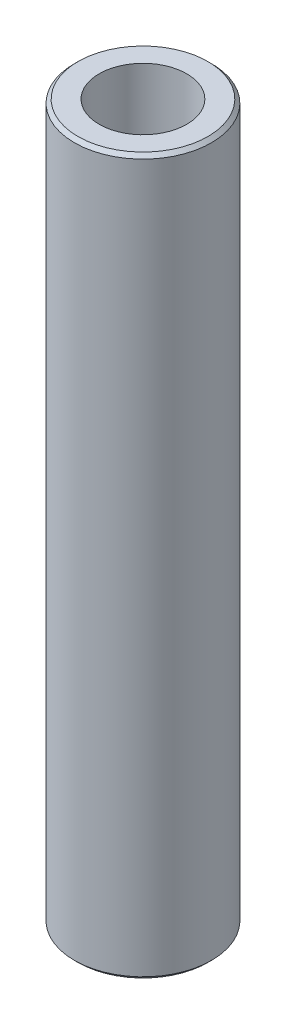
ISO-10303-21;
HEADER;
FILE_DESCRIPTION(('STEP AP214'),'2;1');
FILE_NAME('part.step','',(''),(''),'','','');
FILE_SCHEMA(('AUTOMOTIVE_DESIGN { 1 0 10303 214 1 1 1 1 }'));
ENDSEC;
DATA;
#1=APPLICATION_CONTEXT('core data for automotive mechanical design processes');
#2=APPLICATION_PROTOCOL_DEFINITION('international standard','automotive_design',2000,#1);
#3=PRODUCT_CONTEXT('',#1,'mechanical');
#4=PRODUCT('Part','Part','',(#3));
#5=PRODUCT_RELATED_PRODUCT_CATEGORY('part','',(#4));
#6=PRODUCT_DEFINITION_FORMATION('','',#4);
#7=PRODUCT_DEFINITION_CONTEXT('part definition',#1,'design');
#8=PRODUCT_DEFINITION('design','',#6,#7);
#9=PRODUCT_DEFINITION_SHAPE('','',#8);
#10=(LENGTH_UNIT() NAMED_UNIT(*) SI_UNIT(.MILLI.,.METRE.));
#11=(NAMED_UNIT(*) PLANE_ANGLE_UNIT() SI_UNIT($,.RADIAN.));
#12=(NAMED_UNIT(*) SI_UNIT($,.STERADIAN.) SOLID_ANGLE_UNIT());
#13=UNCERTAINTY_MEASURE_WITH_UNIT(LENGTH_MEASURE(1.E-05),#10,'distance_accuracy_value','');
#14=(GEOMETRIC_REPRESENTATION_CONTEXT(3) GLOBAL_UNCERTAINTY_ASSIGNED_CONTEXT((#13)) GLOBAL_UNIT_ASSIGNED_CONTEXT((#10,
#11,#12)) REPRESENTATION_CONTEXT('',''));
#15=CARTESIAN_POINT('',(0.,0.,0.));
#16=DIRECTION('',(0.,0.,1.));
#17=DIRECTION('',(1.,0.,0.));
#18=AXIS2_PLACEMENT_3D('',#15,#16,#17);
#19=CARTESIAN_POINT('',(0.,600.,0.));
#20=DIRECTION('',(0.,-1.,0.));
#21=DIRECTION('',(0.,0.,-1.));
#22=AXIS2_PLACEMENT_3D('',#19,#20,#21);
#23=CYLINDRICAL_SURFACE('',#22,57.5);
#24=CARTESIAN_POINT('',(0.,596.989709416284,0.));
#25=DIRECTION('',(0.,1.,0.));
#26=DIRECTION('',(0.,0.,1.));
#27=AXIS2_PLACEMENT_3D('',#24,#25,#26);
#28=CIRCLE('',#27,57.5);
#29=CARTESIAN_POINT('',(0.,596.989709416284,57.5));
#30=VERTEX_POINT('',#29);
#31=EDGE_CURVE('E50',#30,#30,#28,.F.);
#32=ORIENTED_EDGE('',*,*,#31,.T.);
#33=EDGE_LOOP('',(#32));
#34=FACE_BOUND('',#33,.T.);
#35=CARTESIAN_POINT('',(0.,3.01029058371627,0.));
#36=DIRECTION('',(0.,1.,0.));
#37=DIRECTION('',(0.,0.,1.));
#38=AXIS2_PLACEMENT_3D('',#35,#36,#37);
#39=CIRCLE('',#38,57.5);
#40=CARTESIAN_POINT('',(0.,3.01029058371627,57.5));
#41=VERTEX_POINT('',#40);
#42=EDGE_CURVE('E51',#41,#41,#39,.T.);
#43=ORIENTED_EDGE('',*,*,#42,.T.);
#44=EDGE_LOOP('',(#43));
#45=FACE_BOUND('',#44,.T.);
#46=ADVANCED_FACE('F39',(#34,#45),#23,.T.);
#47=CARTESIAN_POINT('',(0.,600.,0.));
#48=DIRECTION('',(0.,1.,0.));
#49=DIRECTION('',(0.,0.,1.));
#50=AXIS2_PLACEMENT_3D('',#47,#48,#49);
#51=PLANE('',#50);
#52=CARTESIAN_POINT('',(0.,600.,0.));
#53=DIRECTION('',(0.,1.,0.));
#54=DIRECTION('',(0.,0.,1.));
#55=AXIS2_PLACEMENT_3D('',#52,#53,#54);
#56=CIRCLE('',#55,54.4897094162837);
#57=CARTESIAN_POINT('',(0.,600.,54.4897094162837));
#58=VERTEX_POINT('',#57);
#59=EDGE_CURVE('E54',#58,#58,#56,.T.);
#60=ORIENTED_EDGE('',*,*,#59,.T.);
#61=EDGE_LOOP('',(#60));
#62=FACE_BOUND('',#61,.T.);
#63=CARTESIAN_POINT('',(0.,600.,0.));
#64=DIRECTION('',(0.,1.,0.));
#65=DIRECTION('',(0.,0.,1.));
#66=AXIS2_PLACEMENT_3D('',#63,#64,#65);
#67=CIRCLE('',#66,36.7354089002283);
#68=CARTESIAN_POINT('',(0.,600.,36.7354089002283));
#69=VERTEX_POINT('',#68);
#70=EDGE_CURVE('E58',#69,#69,#67,.T.);
#71=ORIENTED_EDGE('',*,*,#70,.F.);
#72=EDGE_LOOP('',(#71));
#73=FACE_BOUND('',#72,.T.);
#74=ADVANCED_FACE('F69',(#62,#73),#51,.T.);
#75=CARTESIAN_POINT('',(0.,0.,0.));
#76=DIRECTION('',(0.,1.,0.));
#77=DIRECTION('',(0.,0.,1.));
#78=AXIS2_PLACEMENT_3D('',#75,#76,#77);
#79=PLANE('',#78);
#80=CARTESIAN_POINT('',(0.,0.,0.));
#81=DIRECTION('',(0.,1.,0.));
#82=DIRECTION('',(0.,0.,1.));
#83=AXIS2_PLACEMENT_3D('',#80,#81,#82);
#84=CIRCLE('',#83,54.4897094162837);
#85=CARTESIAN_POINT('',(0.,0.,54.4897094162837));
#86=VERTEX_POINT('',#85);
#87=EDGE_CURVE('E10',#86,#86,#84,.F.);
#88=ORIENTED_EDGE('',*,*,#87,.T.);
#89=EDGE_LOOP('',(#88));
#90=FACE_BOUND('',#89,.T.);
#91=CARTESIAN_POINT('',(0.,0.,0.));
#92=DIRECTION('',(0.,1.,0.));
#93=DIRECTION('',(0.,0.,1.));
#94=AXIS2_PLACEMENT_3D('',#91,#92,#93);
#95=CIRCLE('',#94,36.7354089002283);
#96=CARTESIAN_POINT('',(0.,0.,36.7354089002283));
#97=VERTEX_POINT('',#96);
#98=EDGE_CURVE('E63',#97,#97,#95,.T.);
#99=ORIENTED_EDGE('',*,*,#98,.T.);
#100=EDGE_LOOP('',(#99));
#101=FACE_BOUND('',#100,.T.);
#102=ADVANCED_FACE('F75',(#90,#101),#79,.F.);
#103=CARTESIAN_POINT('',(0.,600.,0.));
#104=DIRECTION('',(0.,-1.,0.));
#105=DIRECTION('',(0.,0.,-1.));
#106=AXIS2_PLACEMENT_3D('',#103,#104,#105);
#107=CYLINDRICAL_SURFACE('',#106,36.7354089002283);
#108=ORIENTED_EDGE('',*,*,#70,.T.);
#109=EDGE_LOOP('',(#108));
#110=FACE_BOUND('',#109,.T.);
#111=ORIENTED_EDGE('',*,*,#98,.F.);
#112=EDGE_LOOP('',(#111));
#113=FACE_BOUND('',#112,.T.);
#114=ADVANCED_FACE('F70',(#110,#113),#107,.F.);
#115=CARTESIAN_POINT('',(0.,600.,0.));
#116=DIRECTION('',(0.,-1.,0.));
#117=DIRECTION('',(0.,0.,-1.));
#118=AXIS2_PLACEMENT_3D('',#115,#116,#117);
#119=CONICAL_SURFACE('',#118,54.4897094162837,0.78539816339744);
#120=ORIENTED_EDGE('',*,*,#31,.F.);
#121=EDGE_LOOP('',(#120));
#122=FACE_BOUND('',#121,.T.);
#123=ORIENTED_EDGE('',*,*,#59,.F.);
#124=EDGE_LOOP('',(#123));
#125=FACE_BOUND('',#124,.T.);
#126=ADVANCED_FACE('F81',(#122,#125),#119,.T.);
#127=CARTESIAN_POINT('',(0.,3.01029058371627,0.));
#128=DIRECTION('',(0.,1.,0.));
#129=DIRECTION('',(0.,0.,1.));
#130=AXIS2_PLACEMENT_3D('',#127,#128,#129);
#131=CONICAL_SURFACE('',#130,57.5,0.785398163397448);
#132=CARTESIAN_POINT('',(0.,0.,54.4897094162837));
#133=CARTESIAN_POINT('',(0.,0.0313571935803793,54.5210666098641));
#134=CARTESIAN_POINT('',(0.,0.0627143871607564,54.5524238034445));
#135=CARTESIAN_POINT('',(0.,0.125428774321511,54.6151381906052));
#136=CARTESIAN_POINT('',(0.,0.156785967901888,54.6464953841856));
#137=CARTESIAN_POINT('',(0.,0.219500355062644,54.7092097713464));
#138=CARTESIAN_POINT('',(0.,0.250857548643023,54.7405669649268));
#139=CARTESIAN_POINT('',(0.,0.313571935803778,54.8032813520875));
#140=CARTESIAN_POINT('',(0.,0.344929129384155,54.8346385456679));
#141=CARTESIAN_POINT('',(0.,0.40764351654491,54.8973529328286));
#142=CARTESIAN_POINT('',(0.,0.439000710125289,54.928710126409));
#143=CARTESIAN_POINT('',(0.,0.501715097286045,54.9914245135698));
#144=CARTESIAN_POINT('',(0.,0.533072290866421,55.0227817071502));
#145=CARTESIAN_POINT('',(0.,0.595786678027177,55.0854960943109));
#146=CARTESIAN_POINT('',(0.,0.627143871607556,55.1168532878913));
#147=CARTESIAN_POINT('',(0.,0.689858258768312,55.179567675052));
#148=CARTESIAN_POINT('',(0.,0.721215452348688,55.2109248686324));
#149=CARTESIAN_POINT('',(0.,0.783929839509444,55.2736392557932));
#150=CARTESIAN_POINT('',(0.,0.815287033089823,55.3049964493736));
#151=CARTESIAN_POINT('',(0.,0.878001420250578,55.3677108365343));
#152=CARTESIAN_POINT('',(0.,0.909358613830955,55.3990680301147));
#153=CARTESIAN_POINT('',(0.,0.972073000991711,55.4617824172754));
#154=CARTESIAN_POINT('',(0.,1.00343019457209,55.4931396108558));
#155=CARTESIAN_POINT('',(0.,1.06614458173285,55.5558539980166));
#156=CARTESIAN_POINT('',(0.,1.09750177531322,55.587211191597));
#157=CARTESIAN_POINT('',(0.,1.16021616247398,55.6499255787577));
#158=CARTESIAN_POINT('',(0.,1.19157335605436,55.6812827723381));
#159=CARTESIAN_POINT('',(0.,1.25428774321511,55.7439971594988));
#160=CARTESIAN_POINT('',(0.,1.28564493679549,55.7753543530792));
#161=CARTESIAN_POINT('',(0.,1.34835932395624,55.83806874024));
#162=CARTESIAN_POINT('',(0.,1.37971651753662,55.8694259338204));
#163=CARTESIAN_POINT('',(0.,1.44243090469738,55.9321403209811));
#164=CARTESIAN_POINT('',(0.,1.47378809827776,55.9634975145615));
#165=CARTESIAN_POINT('',(0.,1.53650248543851,56.0262119017222));
#166=CARTESIAN_POINT('',(0.,1.56785967901889,56.0575690953026));
#167=CARTESIAN_POINT('',(0.,1.63057406617965,56.1202834824634));
#168=CARTESIAN_POINT('',(0.,1.66193125976002,56.1516406760438));
#169=CARTESIAN_POINT('',(0.,1.72464564692078,56.2143550632045));
#170=CARTESIAN_POINT('',(0.,1.75600284050116,56.2457122567849));
#171=CARTESIAN_POINT('',(0.,1.81871722766191,56.3084266439456));
#172=CARTESIAN_POINT('',(0.,1.85007442124229,56.339783837526));
#173=CARTESIAN_POINT('',(0.,1.91278880840304,56.4024982246868));
#174=CARTESIAN_POINT('',(0.,1.94414600198342,56.4338554182672));
#175=CARTESIAN_POINT('',(0.,2.00686038914418,56.4965698054279));
#176=CARTESIAN_POINT('',(0.,2.03821758272456,56.5279269990083));
#177=CARTESIAN_POINT('',(0.,2.10093196988531,56.590641386169));
#178=CARTESIAN_POINT('',(0.,2.13228916346569,56.6219985797494));
#179=CARTESIAN_POINT('',(0.,2.19500355062645,56.6847129669102));
#180=CARTESIAN_POINT('',(0.,2.22636074420682,56.7160701604906));
#181=CARTESIAN_POINT('',(0.,2.28907513136758,56.7787845476513));
#182=CARTESIAN_POINT('',(0.,2.32043232494796,56.8101417412317));
#183=CARTESIAN_POINT('',(0.,2.38314671210871,56.8728561283924));
#184=CARTESIAN_POINT('',(0.,2.41450390568909,56.9042133219728));
#185=CARTESIAN_POINT('',(0.,2.47721829284984,56.9669277091336));
#186=CARTESIAN_POINT('',(0.,2.50857548643022,56.998284902714));
#187=CARTESIAN_POINT('',(0.,2.57128987359098,57.0609992898747));
#188=CARTESIAN_POINT('',(0.,2.60264706717136,57.0923564834551));
#189=CARTESIAN_POINT('',(0.,2.66536145433211,57.1550708706158));
#190=CARTESIAN_POINT('',(0.,2.69671864791249,57.1864280641962));
#191=CARTESIAN_POINT('',(0.,2.75943303507325,57.249142451357));
#192=CARTESIAN_POINT('',(0.,2.79079022865362,57.2804996449374));
#193=CARTESIAN_POINT('',(0.,2.85350461581438,57.3432140320981));
#194=CARTESIAN_POINT('',(0.,2.88486180939476,57.3745712256785));
#195=CARTESIAN_POINT('',(0.,2.94757619655551,57.4372856128392));
#196=CARTESIAN_POINT('',(0.,2.97893339013589,57.4686428064196));
#197=CARTESIAN_POINT('',(0.,3.01029058371627,57.5));
#198=B_SPLINE_CURVE_WITH_KNOTS('',3,(#132,#133,#134,#135,#136,#137,#138,#139,#140,#141,#142,
#143,#144,#145,#146,#147,#148,#149,#150,#151,#152,#153,#154,#155,#156,#157,#158,#159,#160,#161,
#162,#163,#164,#165,#166,#167,#168,#169,#170,#171,#172,#173,#174,#175,#176,#177,#178,#179,#180,
#181,#182,#183,#184,#185,#186,#187,#188,#189,#190,#191,#192,#193,#194,#195,#196,#197),
.UNSPECIFIED.,.F.,.F.,(4,2,2,2,2,2,2,2,2,2,2,2,2,2,2,2,2,2,2,2,2,2,2,2,2,2,2,2,2,2,2,2,4),(0.,
0.133037305317984,0.266074610635973,0.399111915953957,0.532149221271946,0.66518652658993,
0.798223831907919,0.931261137225903,1.06429844254389,1.19733574786188,1.33037305317986,
1.46341035849785,1.59644766381584,1.72948496913382,1.86252227445181,1.9955595797698,
2.12859688508778,2.26163419040577,2.39467149572376,2.52770880104174,2.66074610635973,
2.79378341167771,2.9268207169957,3.05985802231369,3.19289532763168,3.32593263294966,
3.45896993826765,3.59200724358563,3.72504454890362,3.85808185422161,3.9911191595396,
4.12415646485758,4.25719377017557),.UNSPECIFIED.);
#199=EDGE_CURVE('BSEAM45',#86,#41,#198,.T.);
#200=ORIENTED_EDGE('',*,*,#87,.F.);
#201=ORIENTED_EDGE('',*,*,#42,.F.);
#202=ORIENTED_EDGE('',*,*,#199,.T.);
#203=ORIENTED_EDGE('',*,*,#199,.F.);
#204=EDGE_LOOP('',(#200,#202,#201,#203));
#205=FACE_BOUND('',#204,.T.);
#206=ADVANCED_FACE('F45',(#205),#131,.T.);
#207=CLOSED_SHELL('',(#46,#74,#102,#114,#126,#206));
#208=MANIFOLD_SOLID_BREP('B2',#207);
#209=ADVANCED_BREP_SHAPE_REPRESENTATION('',(#18,#208),#14);
#210=SHAPE_DEFINITION_REPRESENTATION(#9,#209);
ENDSEC;
END-ISO-10303-21;
